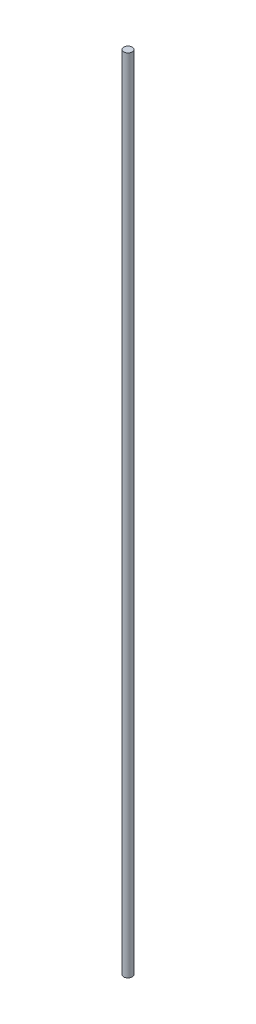
ISO-10303-21;
HEADER;
FILE_DESCRIPTION(('STEP AP214'),'2;1');
FILE_NAME('part.step','',(''),(''),'','','');
FILE_SCHEMA(('AUTOMOTIVE_DESIGN { 1 0 10303 214 1 1 1 1 }'));
ENDSEC;
DATA;
#1=APPLICATION_CONTEXT('core data for automotive mechanical design processes');
#2=APPLICATION_PROTOCOL_DEFINITION('international standard','automotive_design',2000,#1);
#3=PRODUCT_CONTEXT('',#1,'mechanical');
#4=PRODUCT('Part','Part','',(#3));
#5=PRODUCT_RELATED_PRODUCT_CATEGORY('part','',(#4));
#6=PRODUCT_DEFINITION_FORMATION('','',#4);
#7=PRODUCT_DEFINITION_CONTEXT('part definition',#1,'design');
#8=PRODUCT_DEFINITION('design','',#6,#7);
#9=PRODUCT_DEFINITION_SHAPE('','',#8);
#10=(LENGTH_UNIT() NAMED_UNIT(*) SI_UNIT(.MILLI.,.METRE.));
#11=(NAMED_UNIT(*) PLANE_ANGLE_UNIT() SI_UNIT($,.RADIAN.));
#12=(NAMED_UNIT(*) SI_UNIT($,.STERADIAN.) SOLID_ANGLE_UNIT());
#13=UNCERTAINTY_MEASURE_WITH_UNIT(LENGTH_MEASURE(1.E-05),#10,'distance_accuracy_value','');
#14=(GEOMETRIC_REPRESENTATION_CONTEXT(3) GLOBAL_UNCERTAINTY_ASSIGNED_CONTEXT((#13)) GLOBAL_UNIT_ASSIGNED_CONTEXT((#10,
#11,#12)) REPRESENTATION_CONTEXT('',''));
#15=CARTESIAN_POINT('',(0.,0.,0.));
#16=DIRECTION('',(0.,0.,1.));
#17=DIRECTION('',(1.,0.,0.));
#18=AXIS2_PLACEMENT_3D('',#15,#16,#17);
#19=CARTESIAN_POINT('',(0.,750.,0.));
#20=DIRECTION('',(0.,-1.,0.));
#21=DIRECTION('',(0.,0.,-1.));
#22=AXIS2_PLACEMENT_3D('',#19,#20,#21);
#23=CYLINDRICAL_SURFACE('',#22,4.);
#24=CARTESIAN_POINT('',(0.,750.,0.));
#25=DIRECTION('',(0.,1.,0.));
#26=DIRECTION('',(0.,0.,1.));
#27=AXIS2_PLACEMENT_3D('',#24,#25,#26);
#28=CIRCLE('',#27,4.);
#29=CARTESIAN_POINT('',(0.,750.,4.));
#30=VERTEX_POINT('',#29);
#31=EDGE_CURVE('E10',#30,#30,#28,.T.);
#32=ORIENTED_EDGE('',*,*,#31,.F.);
#33=EDGE_LOOP('',(#32));
#34=FACE_BOUND('',#33,.T.);
#35=CARTESIAN_POINT('',(0.,0.,0.));
#36=DIRECTION('',(0.,1.,0.));
#37=DIRECTION('',(0.,0.,1.));
#38=AXIS2_PLACEMENT_3D('',#35,#36,#37);
#39=CIRCLE('',#38,4.);
#40=CARTESIAN_POINT('',(0.,0.,4.));
#41=VERTEX_POINT('',#40);
#42=EDGE_CURVE('E40',#41,#41,#39,.T.);
#43=ORIENTED_EDGE('',*,*,#42,.T.);
#44=EDGE_LOOP('',(#43));
#45=FACE_BOUND('',#44,.T.);
#46=ADVANCED_FACE('F37',(#34,#45),#23,.T.);
#47=CARTESIAN_POINT('',(0.,750.,0.));
#48=DIRECTION('',(0.,1.,0.));
#49=DIRECTION('',(0.,0.,1.));
#50=AXIS2_PLACEMENT_3D('',#47,#48,#49);
#51=PLANE('',#50);
#52=ORIENTED_EDGE('',*,*,#31,.T.);
#53=EDGE_LOOP('',(#52));
#54=FACE_BOUND('',#53,.T.);
#55=ADVANCED_FACE('F52',(#54),#51,.T.);
#56=CARTESIAN_POINT('',(0.,0.,0.));
#57=DIRECTION('',(0.,1.,0.));
#58=DIRECTION('',(0.,0.,1.));
#59=AXIS2_PLACEMENT_3D('',#56,#57,#58);
#60=PLANE('',#59);
#61=ORIENTED_EDGE('',*,*,#42,.F.);
#62=EDGE_LOOP('',(#61));
#63=FACE_BOUND('',#62,.T.);
#64=ADVANCED_FACE('F50',(#63),#60,.F.);
#65=CLOSED_SHELL('',(#46,#55,#64));
#66=MANIFOLD_SOLID_BREP('B2',#65);
#67=ADVANCED_BREP_SHAPE_REPRESENTATION('',(#18,#66),#14);
#68=SHAPE_DEFINITION_REPRESENTATION(#9,#67);
ENDSEC;
END-ISO-10303-21;
